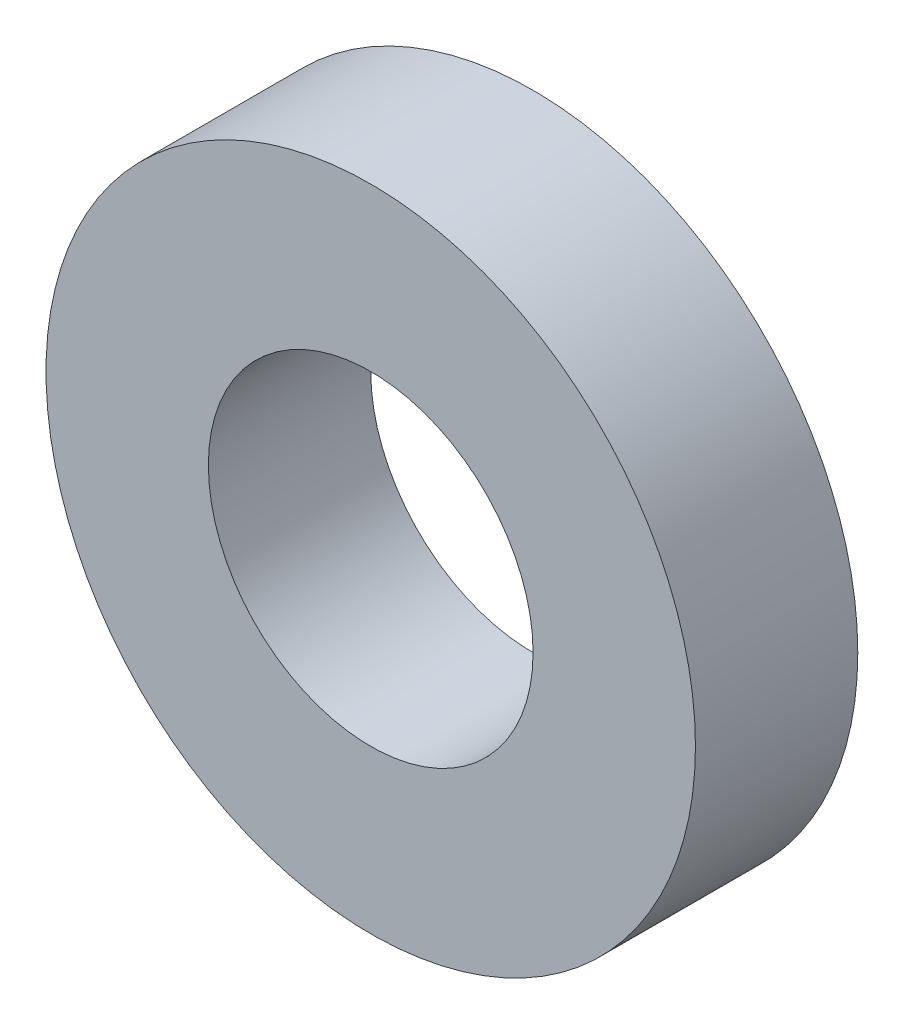
ISO-10303-21;
HEADER;
FILE_DESCRIPTION(('STEP AP214'),'2;1');
FILE_NAME('part.step','',(''),(''),'','','');
FILE_SCHEMA(('AUTOMOTIVE_DESIGN { 1 0 10303 214 1 1 1 1 }'));
ENDSEC;
DATA;
#1=APPLICATION_CONTEXT('core data for automotive mechanical design processes');
#2=APPLICATION_PROTOCOL_DEFINITION('international standard','automotive_design',2000,#1);
#3=PRODUCT_CONTEXT('',#1,'mechanical');
#4=PRODUCT('Part','Part','',(#3));
#5=PRODUCT_RELATED_PRODUCT_CATEGORY('part','',(#4));
#6=PRODUCT_DEFINITION_FORMATION('','',#4);
#7=PRODUCT_DEFINITION_CONTEXT('part definition',#1,'design');
#8=PRODUCT_DEFINITION('design','',#6,#7);
#9=PRODUCT_DEFINITION_SHAPE('','',#8);
#10=(LENGTH_UNIT() NAMED_UNIT(*) SI_UNIT(.MILLI.,.METRE.));
#11=(NAMED_UNIT(*) PLANE_ANGLE_UNIT() SI_UNIT($,.RADIAN.));
#12=(NAMED_UNIT(*) SI_UNIT($,.STERADIAN.) SOLID_ANGLE_UNIT());
#13=UNCERTAINTY_MEASURE_WITH_UNIT(LENGTH_MEASURE(1.E-05),#10,'distance_accuracy_value','');
#14=(GEOMETRIC_REPRESENTATION_CONTEXT(3) GLOBAL_UNCERTAINTY_ASSIGNED_CONTEXT((#13)) GLOBAL_UNIT_ASSIGNED_CONTEXT((#10,
#11,#12)) REPRESENTATION_CONTEXT('',''));
#15=CARTESIAN_POINT('',(0.,0.,0.));
#16=DIRECTION('',(0.,0.,1.));
#17=DIRECTION('',(1.,0.,0.));
#18=AXIS2_PLACEMENT_3D('',#15,#16,#17);
#19=CARTESIAN_POINT('',(0.,0.,0.));
#20=DIRECTION('',(0.,0.,1.));
#21=DIRECTION('',(1.,0.,0.));
#22=AXIS2_PLACEMENT_3D('',#19,#20,#21);
#23=CYLINDRICAL_SURFACE('',#22,0.5);
#24=CARTESIAN_POINT('',(0.,0.,0.));
#25=DIRECTION('',(0.,0.,1.));
#26=DIRECTION('',(1.,0.,0.));
#27=AXIS2_PLACEMENT_3D('',#24,#25,#26);
#28=CIRCLE('',#27,0.5);
#29=CARTESIAN_POINT('',(0.5,0.,0.));
#30=VERTEX_POINT('',#29);
#31=EDGE_CURVE('E49',#30,#30,#28,.T.);
#32=ORIENTED_EDGE('',*,*,#31,.T.);
#33=EDGE_LOOP('',(#32));
#34=FACE_BOUND('',#33,.T.);
#35=CARTESIAN_POINT('',(0.,0.,-0.5));
#36=DIRECTION('',(0.,0.,1.));
#37=DIRECTION('',(1.,0.,0.));
#38=AXIS2_PLACEMENT_3D('',#35,#36,#37);
#39=CIRCLE('',#38,0.5);
#40=CARTESIAN_POINT('',(0.5,0.,-0.5));
#41=VERTEX_POINT('',#40);
#42=EDGE_CURVE('E10',#41,#41,#39,.T.);
#43=ORIENTED_EDGE('',*,*,#42,.F.);
#44=EDGE_LOOP('',(#43));
#45=FACE_BOUND('',#44,.T.);
#46=ADVANCED_FACE('F35',(#34,#45),#23,.F.);
#47=CARTESIAN_POINT('',(0.5,0.,-0.5));
#48=DIRECTION('',(0.,0.,-1.));
#49=DIRECTION('',(-1.,0.,0.));
#50=AXIS2_PLACEMENT_3D('',#47,#48,#49);
#51=PLANE('',#50);
#52=ORIENTED_EDGE('',*,*,#42,.T.);
#53=EDGE_LOOP('',(#52));
#54=FACE_BOUND('',#53,.T.);
#55=CARTESIAN_POINT('',(0.,0.,-0.5));
#56=DIRECTION('',(0.,0.,1.));
#57=DIRECTION('',(1.,0.,0.));
#58=AXIS2_PLACEMENT_3D('',#55,#56,#57);
#59=CIRCLE('',#58,1.);
#60=CARTESIAN_POINT('',(1.,0.,-0.5));
#61=VERTEX_POINT('',#60);
#62=EDGE_CURVE('E41',#61,#61,#59,.T.);
#63=ORIENTED_EDGE('',*,*,#62,.F.);
#64=EDGE_LOOP('',(#63));
#65=FACE_BOUND('',#64,.T.);
#66=ADVANCED_FACE('F65',(#54,#65),#51,.T.);
#67=CARTESIAN_POINT('',(0.,0.,0.));
#68=DIRECTION('',(0.,0.,1.));
#69=DIRECTION('',(1.,0.,0.));
#70=AXIS2_PLACEMENT_3D('',#67,#68,#69);
#71=CYLINDRICAL_SURFACE('',#70,1.);
#72=ORIENTED_EDGE('',*,*,#62,.T.);
#73=EDGE_LOOP('',(#72));
#74=FACE_BOUND('',#73,.T.);
#75=CARTESIAN_POINT('',(0.,0.,0.));
#76=DIRECTION('',(0.,0.,1.));
#77=DIRECTION('',(1.,0.,0.));
#78=AXIS2_PLACEMENT_3D('',#75,#76,#77);
#79=CIRCLE('',#78,1.);
#80=CARTESIAN_POINT('',(1.,0.,0.));
#81=VERTEX_POINT('',#80);
#82=EDGE_CURVE('E45',#81,#81,#79,.T.);
#83=ORIENTED_EDGE('',*,*,#82,.F.);
#84=EDGE_LOOP('',(#83));
#85=FACE_BOUND('',#84,.T.);
#86=ADVANCED_FACE('F59',(#74,#85),#71,.T.);
#87=CARTESIAN_POINT('',(0.5,0.,0.));
#88=DIRECTION('',(0.,0.,1.));
#89=DIRECTION('',(1.,0.,0.));
#90=AXIS2_PLACEMENT_3D('',#87,#88,#89);
#91=PLANE('',#90);
#92=ORIENTED_EDGE('',*,*,#82,.T.);
#93=EDGE_LOOP('',(#92));
#94=FACE_BOUND('',#93,.T.);
#95=ORIENTED_EDGE('',*,*,#31,.F.);
#96=EDGE_LOOP('',(#95));
#97=FACE_BOUND('',#96,.T.);
#98=ADVANCED_FACE('F57',(#94,#97),#91,.T.);
#99=CLOSED_SHELL('',(#46,#66,#86,#98));
#100=MANIFOLD_SOLID_BREP('B2',#99);
#101=ADVANCED_BREP_SHAPE_REPRESENTATION('',(#18,#100),#14);
#102=SHAPE_DEFINITION_REPRESENTATION(#9,#101);
ENDSEC;
END-ISO-10303-21;
